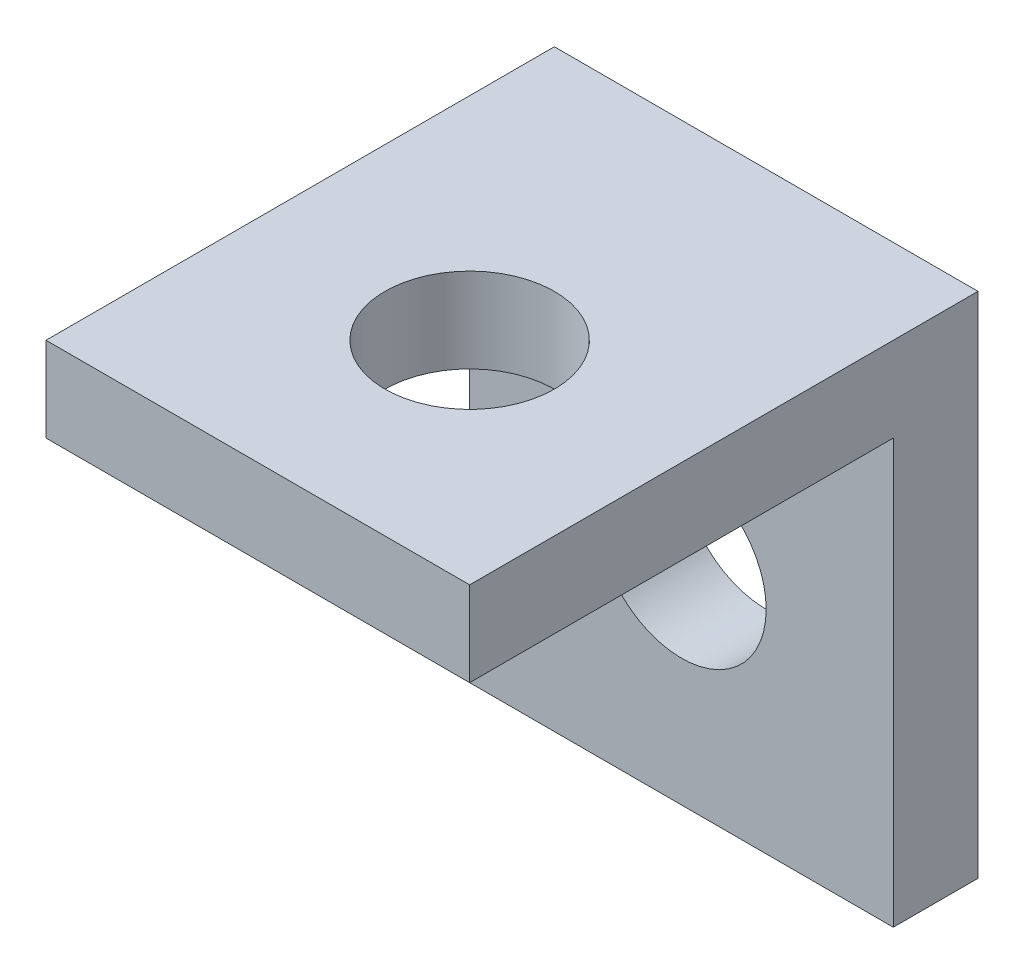
ISO-10303-21;
HEADER;
FILE_DESCRIPTION(('STEP AP214'),'2;1');
FILE_NAME('part.step','',(''),(''),'','','');
FILE_SCHEMA(('AUTOMOTIVE_DESIGN { 1 0 10303 214 1 1 1 1 }'));
ENDSEC;
DATA;
#1=APPLICATION_CONTEXT('core data for automotive mechanical design processes');
#2=APPLICATION_PROTOCOL_DEFINITION('international standard','automotive_design',2000,#1);
#3=PRODUCT_CONTEXT('',#1,'mechanical');
#4=PRODUCT('Part','Part','',(#3));
#5=PRODUCT_RELATED_PRODUCT_CATEGORY('part','',(#4));
#6=PRODUCT_DEFINITION_FORMATION('','',#4);
#7=PRODUCT_DEFINITION_CONTEXT('part definition',#1,'design');
#8=PRODUCT_DEFINITION('design','',#6,#7);
#9=PRODUCT_DEFINITION_SHAPE('','',#8);
#10=(LENGTH_UNIT() NAMED_UNIT(*) SI_UNIT(.MILLI.,.METRE.));
#11=(NAMED_UNIT(*) PLANE_ANGLE_UNIT() SI_UNIT($,.RADIAN.));
#12=(NAMED_UNIT(*) SI_UNIT($,.STERADIAN.) SOLID_ANGLE_UNIT());
#13=UNCERTAINTY_MEASURE_WITH_UNIT(LENGTH_MEASURE(1.E-05),#10,'distance_accuracy_value','');
#14=(GEOMETRIC_REPRESENTATION_CONTEXT(3) GLOBAL_UNCERTAINTY_ASSIGNED_CONTEXT((#13)) GLOBAL_UNIT_ASSIGNED_CONTEXT((#10,
#11,#12)) REPRESENTATION_CONTEXT('',''));
#15=CARTESIAN_POINT('',(0.,0.,0.));
#16=DIRECTION('',(0.,0.,1.));
#17=DIRECTION('',(1.,0.,0.));
#18=AXIS2_PLACEMENT_3D('',#15,#16,#17);
#19=CARTESIAN_POINT('',(-5.3416149068323,3.55590062111801,1.));
#20=DIRECTION('',(1.,0.,0.));
#21=DIRECTION('',(0.,1.,0.));
#22=AXIS2_PLACEMENT_3D('',#19,#20,#21);
#23=PLANE('',#22);
#24=DIRECTION('',(0.,-1.,0.));
#25=VECTOR('',#24,1.);
#26=CARTESIAN_POINT('',(-5.3416149068323,3.55590062111801,0.));
#27=LINE('',#26,#25);
#28=CARTESIAN_POINT('',(-5.3416149068323,3.55590062111801,0.));
#29=VERTEX_POINT('',#28);
#30=CARTESIAN_POINT('',(-5.34161490683229,-2.44409937888199,0.));
#31=VERTEX_POINT('',#30);
#32=EDGE_CURVE('E156',#29,#31,#27,.T.);
#33=ORIENTED_EDGE('',*,*,#32,.T.);
#34=DIRECTION('',(0.,0.,-1.));
#35=VECTOR('',#34,1.);
#36=CARTESIAN_POINT('',(-5.34161490683229,-2.44409937888199,1.));
#37=LINE('',#36,#35);
#38=CARTESIAN_POINT('',(-5.34161490683229,-2.44409937888199,1.));
#39=VERTEX_POINT('',#38);
#40=EDGE_CURVE('E114',#39,#31,#37,.T.);
#41=ORIENTED_EDGE('',*,*,#40,.F.);
#42=DIRECTION('',(0.,-1.,0.));
#43=VECTOR('',#42,1.);
#44=CARTESIAN_POINT('',(-5.3416149068323,3.55590062111801,1.));
#45=LINE('',#44,#43);
#46=CARTESIAN_POINT('',(-5.3416149068323,2.55590062111801,1.));
#47=VERTEX_POINT('',#46);
#48=EDGE_CURVE('E105',#47,#39,#45,.T.);
#49=ORIENTED_EDGE('',*,*,#48,.F.);
#50=DIRECTION('',(0.,0.,-1.));
#51=VECTOR('',#50,1.);
#52=CARTESIAN_POINT('',(-5.3416149068323,2.55590062111801,6.));
#53=LINE('',#52,#51);
#54=CARTESIAN_POINT('',(-5.3416149068323,2.55590062111801,6.));
#55=VERTEX_POINT('',#54);
#56=EDGE_CURVE('E152',#55,#47,#53,.T.);
#57=ORIENTED_EDGE('',*,*,#56,.F.);
#58=DIRECTION('',(0.,-1.,0.));
#59=VECTOR('',#58,1.);
#60=CARTESIAN_POINT('',(-5.3416149068323,3.55590062111801,6.));
#61=LINE('',#60,#59);
#62=CARTESIAN_POINT('',(-5.3416149068323,3.55590062111801,6.));
#63=VERTEX_POINT('',#62);
#64=EDGE_CURVE('E133',#63,#55,#61,.T.);
#65=ORIENTED_EDGE('',*,*,#64,.F.);
#66=DIRECTION('',(0.,0.,-1.));
#67=VECTOR('',#66,1.);
#68=CARTESIAN_POINT('',(-5.3416149068323,3.55590062111801,1.));
#69=LINE('',#68,#67);
#70=EDGE_CURVE('E51',#63,#29,#69,.T.);
#71=ORIENTED_EDGE('',*,*,#70,.T.);
#72=EDGE_LOOP('',(#33,#41,#49,#57,#65,#71));
#73=FACE_BOUND('',#72,.T.);
#74=ADVANCED_FACE('F43',(#73),#23,.F.);
#75=CARTESIAN_POINT('',(-0.341614906832295,3.55590062111801,1.));
#76=DIRECTION('',(-1.,0.,0.));
#77=DIRECTION('',(0.,-1.,0.));
#78=AXIS2_PLACEMENT_3D('',#75,#76,#77);
#79=PLANE('',#78);
#80=DIRECTION('',(0.,1.,0.));
#81=VECTOR('',#80,1.);
#82=CARTESIAN_POINT('',(-0.341614906832295,3.55590062111801,0.));
#83=LINE('',#82,#81);
#84=CARTESIAN_POINT('',(-0.341614906832295,-2.44409937888199,0.));
#85=VERTEX_POINT('',#84);
#86=CARTESIAN_POINT('',(-0.341614906832295,3.55590062111801,0.));
#87=VERTEX_POINT('',#86);
#88=EDGE_CURVE('E161',#85,#87,#83,.T.);
#89=ORIENTED_EDGE('',*,*,#88,.T.);
#90=DIRECTION('',(0.,0.,-1.));
#91=VECTOR('',#90,1.);
#92=CARTESIAN_POINT('',(-0.341614906832295,3.55590062111801,1.));
#93=LINE('',#92,#91);
#94=CARTESIAN_POINT('',(-0.341614906832295,3.55590062111801,6.));
#95=VERTEX_POINT('',#94);
#96=EDGE_CURVE('E11',#95,#87,#93,.T.);
#97=ORIENTED_EDGE('',*,*,#96,.F.);
#98=DIRECTION('',(0.,1.,0.));
#99=VECTOR('',#98,1.);
#100=CARTESIAN_POINT('',(-0.341614906832295,3.55590062111801,6.));
#101=LINE('',#100,#99);
#102=CARTESIAN_POINT('',(-0.341614906832295,2.55590062111801,6.));
#103=VERTEX_POINT('',#102);
#104=EDGE_CURVE('E140',#103,#95,#101,.T.);
#105=ORIENTED_EDGE('',*,*,#104,.F.);
#106=DIRECTION('',(0.,0.,-1.));
#107=VECTOR('',#106,1.);
#108=CARTESIAN_POINT('',(-0.341614906832295,2.55590062111801,6.));
#109=LINE('',#108,#107);
#110=CARTESIAN_POINT('',(-0.341614906832295,2.55590062111801,1.));
#111=VERTEX_POINT('',#110);
#112=EDGE_CURVE('E103',#103,#111,#109,.T.);
#113=ORIENTED_EDGE('',*,*,#112,.T.);
#114=DIRECTION('',(0.,1.,0.));
#115=VECTOR('',#114,1.);
#116=CARTESIAN_POINT('',(-0.341614906832295,3.55590062111801,1.));
#117=LINE('',#116,#115);
#118=CARTESIAN_POINT('',(-0.341614906832295,-2.44409937888199,1.));
#119=VERTEX_POINT('',#118);
#120=EDGE_CURVE('E96',#119,#111,#117,.T.);
#121=ORIENTED_EDGE('',*,*,#120,.F.);
#122=DIRECTION('',(0.,0.,1.));
#123=VECTOR('',#122,1.);
#124=CARTESIAN_POINT('',(-0.341614906832295,-2.44409937888199,1.));
#125=LINE('',#124,#123);
#126=EDGE_CURVE('E100',#85,#119,#125,.T.);
#127=ORIENTED_EDGE('',*,*,#126,.F.);
#128=EDGE_LOOP('',(#89,#97,#105,#113,#121,#127));
#129=FACE_BOUND('',#128,.T.);
#130=ADVANCED_FACE('F98',(#129),#79,.F.);
#131=CARTESIAN_POINT('',(-5.3416149068323,3.55590062111801,1.));
#132=DIRECTION('',(0.,-1.,0.));
#133=DIRECTION('',(0.,0.,-1.));
#134=AXIS2_PLACEMENT_3D('',#131,#132,#133);
#135=PLANE('',#134);
#136=CARTESIAN_POINT('',(-2.8416149068323,3.55590062111801,3.5));
#137=DIRECTION('',(0.,-1.,0.));
#138=DIRECTION('',(1.,0.,0.));
#139=AXIS2_PLACEMENT_3D('',#136,#137,#138);
#140=CIRCLE('',#139,1.);
#141=CARTESIAN_POINT('',(-1.8416149068323,3.55590062111801,3.5));
#142=VERTEX_POINT('',#141);
#143=EDGE_CURVE('E207',#142,#142,#140,.T.);
#144=ORIENTED_EDGE('',*,*,#143,.T.);
#145=EDGE_LOOP('',(#144));
#146=FACE_BOUND('',#145,.T.);
#147=DIRECTION('',(-1.,0.,0.));
#148=VECTOR('',#147,1.);
#149=CARTESIAN_POINT('',(-5.3416149068323,3.55590062111801,0.));
#150=LINE('',#149,#148);
#151=EDGE_CURVE('E65',#87,#29,#150,.T.);
#152=ORIENTED_EDGE('',*,*,#151,.T.);
#153=ORIENTED_EDGE('',*,*,#70,.F.);
#154=DIRECTION('',(-1.,0.,0.));
#155=VECTOR('',#154,1.);
#156=CARTESIAN_POINT('',(-5.3416149068323,3.55590062111801,6.));
#157=LINE('',#156,#155);
#158=EDGE_CURVE('E144',#95,#63,#157,.T.);
#159=ORIENTED_EDGE('',*,*,#158,.F.);
#160=ORIENTED_EDGE('',*,*,#96,.T.);
#161=EDGE_LOOP('',(#152,#153,#159,#160));
#162=FACE_BOUND('',#161,.T.);
#163=ADVANCED_FACE('F173',(#146,#162),#135,.F.);
#164=CARTESIAN_POINT('',(0.,0.,1.));
#165=DIRECTION('',(0.,0.,1.));
#166=DIRECTION('',(1.,0.,0.));
#167=AXIS2_PLACEMENT_3D('',#164,#165,#166);
#168=PLANE('',#167);
#169=CARTESIAN_POINT('',(-2.84161490683229,0.0559006211180123,1.));
#170=DIRECTION('',(0.,0.,1.));
#171=DIRECTION('',(1.,0.,0.));
#172=AXIS2_PLACEMENT_3D('',#169,#170,#171);
#173=CIRCLE('',#172,1.);
#174=CARTESIAN_POINT('',(-1.84161490683229,0.0559006211180123,1.));
#175=VERTEX_POINT('',#174);
#176=EDGE_CURVE('E125',#175,#175,#173,.T.);
#177=ORIENTED_EDGE('',*,*,#176,.F.);
#178=EDGE_LOOP('',(#177));
#179=FACE_BOUND('',#178,.T.);
#180=DIRECTION('',(1.,0.,0.));
#181=VECTOR('',#180,1.);
#182=CARTESIAN_POINT('',(-5.3416149068323,2.55590062111801,1.));
#183=LINE('',#182,#181);
#184=EDGE_CURVE('E58',#47,#111,#183,.T.);
#185=ORIENTED_EDGE('',*,*,#184,.F.);
#186=ORIENTED_EDGE('',*,*,#48,.T.);
#187=DIRECTION('',(-1.,0.,0.));
#188=VECTOR('',#187,1.);
#189=CARTESIAN_POINT('',(-0.341614906832295,-2.44409937888199,1.));
#190=LINE('',#189,#188);
#191=EDGE_CURVE('E108',#119,#39,#190,.T.);
#192=ORIENTED_EDGE('',*,*,#191,.F.);
#193=ORIENTED_EDGE('',*,*,#120,.T.);
#194=EDGE_LOOP('',(#185,#186,#192,#193));
#195=FACE_BOUND('',#194,.T.);
#196=ADVANCED_FACE('F109',(#179,#195),#168,.T.);
#197=CARTESIAN_POINT('',(0.,0.,0.));
#198=DIRECTION('',(0.,0.,1.));
#199=DIRECTION('',(1.,0.,0.));
#200=AXIS2_PLACEMENT_3D('',#197,#198,#199);
#201=PLANE('',#200);
#202=CARTESIAN_POINT('',(-2.84161490683229,0.0559006211180123,0.));
#203=DIRECTION('',(0.,0.,1.));
#204=DIRECTION('',(1.,0.,0.));
#205=AXIS2_PLACEMENT_3D('',#202,#203,#204);
#206=CIRCLE('',#205,1.);
#207=CARTESIAN_POINT('',(-1.84161490683229,0.0559006211180123,0.));
#208=VERTEX_POINT('',#207);
#209=EDGE_CURVE('E121',#208,#208,#206,.T.);
#210=ORIENTED_EDGE('',*,*,#209,.T.);
#211=EDGE_LOOP('',(#210));
#212=FACE_BOUND('',#211,.T.);
#213=ORIENTED_EDGE('',*,*,#32,.F.);
#214=ORIENTED_EDGE('',*,*,#151,.F.);
#215=ORIENTED_EDGE('',*,*,#88,.F.);
#216=DIRECTION('',(1.,0.,0.));
#217=VECTOR('',#216,1.);
#218=CARTESIAN_POINT('',(-0.341614906832295,-2.44409937888199,0.));
#219=LINE('',#218,#217);
#220=EDGE_CURVE('E119',#31,#85,#219,.T.);
#221=ORIENTED_EDGE('',*,*,#220,.F.);
#222=EDGE_LOOP('',(#213,#214,#215,#221));
#223=FACE_BOUND('',#222,.T.);
#224=ADVANCED_FACE('F172',(#212,#223),#201,.F.);
#225=CARTESIAN_POINT('',(-5.3416149068323,2.55590062111801,6.));
#226=DIRECTION('',(0.,1.,0.));
#227=DIRECTION('',(-1.,0.,0.));
#228=AXIS2_PLACEMENT_3D('',#225,#226,#227);
#229=PLANE('',#228);
#230=CARTESIAN_POINT('',(-2.8416149068323,2.55590062111801,3.5));
#231=DIRECTION('',(0.,-1.,0.));
#232=DIRECTION('',(1.,0.,0.));
#233=AXIS2_PLACEMENT_3D('',#230,#231,#232);
#234=CIRCLE('',#233,1.);
#235=CARTESIAN_POINT('',(-1.8416149068323,2.55590062111801,3.5));
#236=VERTEX_POINT('',#235);
#237=EDGE_CURVE('E210',#236,#236,#234,.T.);
#238=ORIENTED_EDGE('',*,*,#237,.F.);
#239=EDGE_LOOP('',(#238));
#240=FACE_BOUND('',#239,.T.);
#241=ORIENTED_EDGE('',*,*,#184,.T.);
#242=ORIENTED_EDGE('',*,*,#112,.F.);
#243=DIRECTION('',(1.,0.,0.));
#244=VECTOR('',#243,1.);
#245=CARTESIAN_POINT('',(-5.3416149068323,2.55590062111801,6.));
#246=LINE('',#245,#244);
#247=EDGE_CURVE('E137',#55,#103,#246,.T.);
#248=ORIENTED_EDGE('',*,*,#247,.F.);
#249=ORIENTED_EDGE('',*,*,#56,.T.);
#250=EDGE_LOOP('',(#241,#242,#248,#249));
#251=FACE_BOUND('',#250,.T.);
#252=ADVANCED_FACE('F177',(#240,#251),#229,.F.);
#253=CARTESIAN_POINT('',(0.,0.,6.));
#254=DIRECTION('',(0.,0.,1.));
#255=DIRECTION('',(1.,0.,0.));
#256=AXIS2_PLACEMENT_3D('',#253,#254,#255);
#257=PLANE('',#256);
#258=ORIENTED_EDGE('',*,*,#64,.T.);
#259=ORIENTED_EDGE('',*,*,#247,.T.);
#260=ORIENTED_EDGE('',*,*,#104,.T.);
#261=ORIENTED_EDGE('',*,*,#158,.T.);
#262=EDGE_LOOP('',(#258,#259,#260,#261));
#263=FACE_BOUND('',#262,.T.);
#264=ADVANCED_FACE('F175',(#263),#257,.T.);
#265=CARTESIAN_POINT('',(0.,-2.44409937888199,0.));
#266=DIRECTION('',(0.,1.,0.));
#267=DIRECTION('',(0.,0.,1.));
#268=AXIS2_PLACEMENT_3D('',#265,#266,#267);
#269=PLANE('',#268);
#270=ORIENTED_EDGE('',*,*,#126,.T.);
#271=ORIENTED_EDGE('',*,*,#191,.T.);
#272=ORIENTED_EDGE('',*,*,#40,.T.);
#273=ORIENTED_EDGE('',*,*,#220,.T.);
#274=EDGE_LOOP('',(#270,#271,#272,#273));
#275=FACE_BOUND('',#274,.T.);
#276=ADVANCED_FACE('F117',(#275),#269,.F.);
#277=CARTESIAN_POINT('',(-2.84161490683229,0.0559006211180123,0.));
#278=DIRECTION('',(0.,0.,1.));
#279=DIRECTION('',(1.,0.,0.));
#280=AXIS2_PLACEMENT_3D('',#277,#278,#279);
#281=CYLINDRICAL_SURFACE('',#280,1.);
#282=ORIENTED_EDGE('',*,*,#209,.F.);
#283=EDGE_LOOP('',(#282));
#284=FACE_BOUND('',#283,.T.);
#285=ORIENTED_EDGE('',*,*,#176,.T.);
#286=EDGE_LOOP('',(#285));
#287=FACE_BOUND('',#286,.T.);
#288=ADVANCED_FACE('F219',(#284,#287),#281,.F.);
#289=CARTESIAN_POINT('',(-2.8416149068323,3.55590062111801,3.5));
#290=DIRECTION('',(0.,-1.,0.));
#291=DIRECTION('',(1.,0.,0.));
#292=AXIS2_PLACEMENT_3D('',#289,#290,#291);
#293=CYLINDRICAL_SURFACE('',#292,1.);
#294=ORIENTED_EDGE('',*,*,#143,.F.);
#295=EDGE_LOOP('',(#294));
#296=FACE_BOUND('',#295,.T.);
#297=ORIENTED_EDGE('',*,*,#237,.T.);
#298=EDGE_LOOP('',(#297));
#299=FACE_BOUND('',#298,.T.);
#300=ADVANCED_FACE('F217',(#296,#299),#293,.F.);
#301=CLOSED_SHELL('',(#74,#130,#163,#196,#224,#252,#264,#276,#288,#300));
#302=MANIFOLD_SOLID_BREP('B2',#301);
#303=ADVANCED_BREP_SHAPE_REPRESENTATION('',(#18,#302),#14);
#304=SHAPE_DEFINITION_REPRESENTATION(#9,#303);
ENDSEC;
END-ISO-10303-21;
